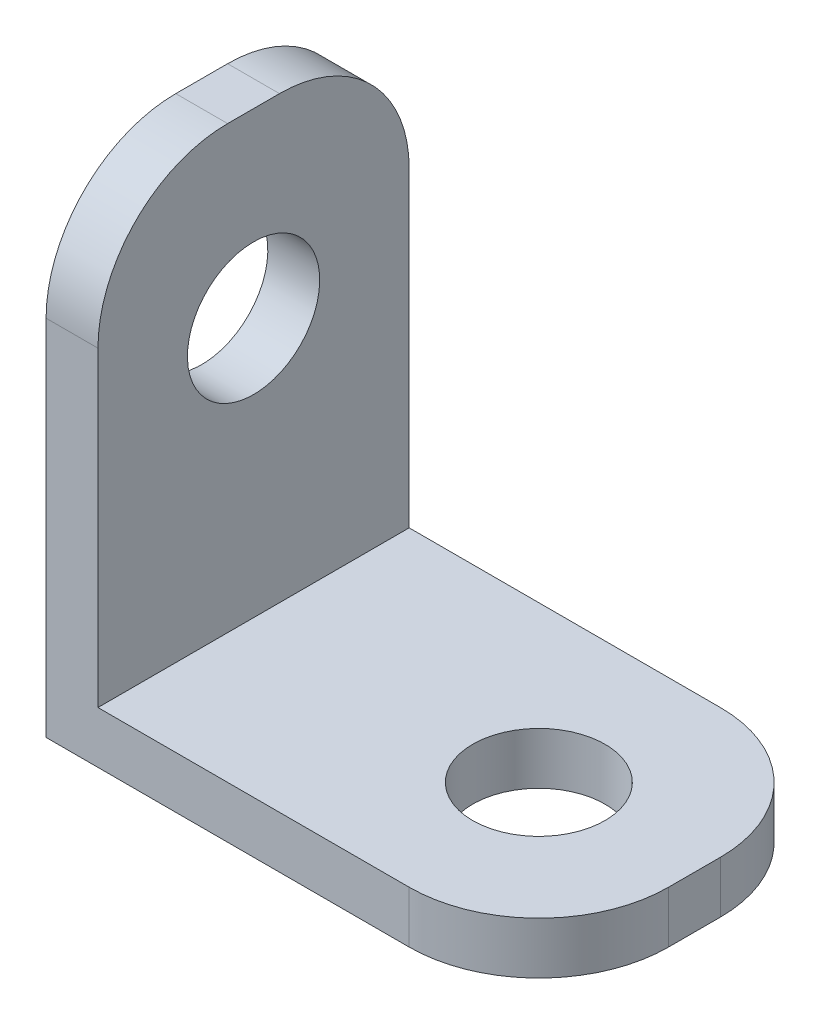
ISO-10303-21;
HEADER;
FILE_DESCRIPTION(('STEP AP214'),'2;1');
FILE_NAME('part.step','',(''),(''),'','','');
FILE_SCHEMA(('AUTOMOTIVE_DESIGN { 1 0 10303 214 1 1 1 1 }'));
ENDSEC;
DATA;
#1=APPLICATION_CONTEXT('core data for automotive mechanical design processes');
#2=APPLICATION_PROTOCOL_DEFINITION('international standard','automotive_design',2000,#1);
#3=PRODUCT_CONTEXT('',#1,'mechanical');
#4=PRODUCT('Part','Part','',(#3));
#5=PRODUCT_RELATED_PRODUCT_CATEGORY('part','',(#4));
#6=PRODUCT_DEFINITION_FORMATION('','',#4);
#7=PRODUCT_DEFINITION_CONTEXT('part definition',#1,'design');
#8=PRODUCT_DEFINITION('design','',#6,#7);
#9=PRODUCT_DEFINITION_SHAPE('','',#8);
#10=(LENGTH_UNIT() NAMED_UNIT(*) SI_UNIT(.MILLI.,.METRE.));
#11=(NAMED_UNIT(*) PLANE_ANGLE_UNIT() SI_UNIT($,.RADIAN.));
#12=(NAMED_UNIT(*) SI_UNIT($,.STERADIAN.) SOLID_ANGLE_UNIT());
#13=UNCERTAINTY_MEASURE_WITH_UNIT(LENGTH_MEASURE(1.E-05),#10,'distance_accuracy_value','');
#14=(GEOMETRIC_REPRESENTATION_CONTEXT(3) GLOBAL_UNCERTAINTY_ASSIGNED_CONTEXT((#13)) GLOBAL_UNIT_ASSIGNED_CONTEXT((#10,
#11,#12)) REPRESENTATION_CONTEXT('',''));
#15=CARTESIAN_POINT('',(0.,0.,0.));
#16=DIRECTION('',(0.,0.,1.));
#17=DIRECTION('',(1.,0.,0.));
#18=AXIS2_PLACEMENT_3D('',#15,#16,#17);
#19=CARTESIAN_POINT('',(19.,2.,12.));
#20=DIRECTION('',(-1.,0.,0.));
#21=DIRECTION('',(0.,0.,1.));
#22=AXIS2_PLACEMENT_3D('',#19,#20,#21);
#23=PLANE('',#22);
#24=DIRECTION('',(0.,0.,-1.));
#25=VECTOR('',#24,1.);
#26=CARTESIAN_POINT('',(19.,2.,12.));
#27=LINE('',#26,#25);
#28=CARTESIAN_POINT('',(19.,2.,7.));
#29=VERTEX_POINT('',#28);
#30=CARTESIAN_POINT('',(19.,2.,5.));
#31=VERTEX_POINT('',#30);
#32=EDGE_CURVE('E41',#29,#31,#27,.T.);
#33=ORIENTED_EDGE('',*,*,#32,.F.);
#34=DIRECTION('',(0.,1.,0.));
#35=VECTOR('',#34,1.);
#36=CARTESIAN_POINT('',(19.,0.,7.));
#37=LINE('',#36,#35);
#38=CARTESIAN_POINT('',(19.,0.,7.));
#39=VERTEX_POINT('',#38);
#40=EDGE_CURVE('E115',#39,#29,#37,.T.);
#41=ORIENTED_EDGE('',*,*,#40,.F.);
#42=DIRECTION('',(0.,0.,-1.));
#43=VECTOR('',#42,1.);
#44=CARTESIAN_POINT('',(19.,0.,12.));
#45=LINE('',#44,#43);
#46=CARTESIAN_POINT('',(19.,0.,5.));
#47=VERTEX_POINT('',#46);
#48=EDGE_CURVE('E11',#39,#47,#45,.T.);
#49=ORIENTED_EDGE('',*,*,#48,.T.);
#50=DIRECTION('',(0.,1.,0.));
#51=VECTOR('',#50,1.);
#52=CARTESIAN_POINT('',(19.,0.,5.));
#53=LINE('',#52,#51);
#54=EDGE_CURVE('E169',#47,#31,#53,.T.);
#55=ORIENTED_EDGE('',*,*,#54,.T.);
#56=EDGE_LOOP('',(#33,#41,#49,#55));
#57=FACE_BOUND('',#56,.T.);
#58=ADVANCED_FACE('F33',(#57),#23,.F.);
#59=CARTESIAN_POINT('',(0.,0.,12.));
#60=DIRECTION('',(0.,0.,-1.));
#61=DIRECTION('',(-1.,0.,0.));
#62=AXIS2_PLACEMENT_3D('',#59,#60,#61);
#63=PLANE('',#62);
#64=DIRECTION('',(0.,1.,0.));
#65=VECTOR('',#64,1.);
#66=CARTESIAN_POINT('',(14.,0.,12.));
#67=LINE('',#66,#65);
#68=CARTESIAN_POINT('',(14.,0.,12.));
#69=VERTEX_POINT('',#68);
#70=CARTESIAN_POINT('',(14.,2.,12.));
#71=VERTEX_POINT('',#70);
#72=EDGE_CURVE('E107',#69,#71,#67,.T.);
#73=ORIENTED_EDGE('',*,*,#72,.T.);
#74=DIRECTION('',(-1.,0.,0.));
#75=VECTOR('',#74,1.);
#76=CARTESIAN_POINT('',(2.,2.,12.));
#77=LINE('',#76,#75);
#78=CARTESIAN_POINT('',(2.,2.,12.));
#79=VERTEX_POINT('',#78);
#80=EDGE_CURVE('E128',#71,#79,#77,.T.);
#81=ORIENTED_EDGE('',*,*,#80,.T.);
#82=DIRECTION('',(0.,1.,0.));
#83=VECTOR('',#82,1.);
#84=CARTESIAN_POINT('',(2.,19.,12.));
#85=LINE('',#84,#83);
#86=CARTESIAN_POINT('',(2.,14.,12.));
#87=VERTEX_POINT('',#86);
#88=EDGE_CURVE('E131',#79,#87,#85,.T.);
#89=ORIENTED_EDGE('',*,*,#88,.T.);
#90=DIRECTION('',(1.,0.,0.));
#91=VECTOR('',#90,1.);
#92=CARTESIAN_POINT('',(0.,14.,12.));
#93=LINE('',#92,#91);
#94=CARTESIAN_POINT('',(0.,14.,12.));
#95=VERTEX_POINT('',#94);
#96=EDGE_CURVE('E147',#95,#87,#93,.T.);
#97=ORIENTED_EDGE('',*,*,#96,.F.);
#98=DIRECTION('',(0.,-1.,0.));
#99=VECTOR('',#98,1.);
#100=CARTESIAN_POINT('',(0.,0.,12.));
#101=LINE('',#100,#99);
#102=CARTESIAN_POINT('',(0.,0.,12.));
#103=VERTEX_POINT('',#102);
#104=EDGE_CURVE('E126',#95,#103,#101,.T.);
#105=ORIENTED_EDGE('',*,*,#104,.T.);
#106=DIRECTION('',(1.,0.,0.));
#107=VECTOR('',#106,1.);
#108=CARTESIAN_POINT('',(19.,0.,12.));
#109=LINE('',#108,#107);
#110=EDGE_CURVE('E121',#103,#69,#109,.T.);
#111=ORIENTED_EDGE('',*,*,#110,.T.);
#112=EDGE_LOOP('',(#73,#81,#89,#97,#105,#111));
#113=FACE_BOUND('',#112,.T.);
#114=ADVANCED_FACE('F123',(#113),#63,.F.);
#115=CARTESIAN_POINT('',(0.,0.,0.));
#116=DIRECTION('',(0.,0.,-1.));
#117=DIRECTION('',(-1.,0.,0.));
#118=AXIS2_PLACEMENT_3D('',#115,#116,#117);
#119=PLANE('',#118);
#120=DIRECTION('',(-1.,0.,0.));
#121=VECTOR('',#120,1.);
#122=CARTESIAN_POINT('',(2.,2.,0.));
#123=LINE('',#122,#121);
#124=CARTESIAN_POINT('',(14.,2.,0.));
#125=VERTEX_POINT('',#124);
#126=CARTESIAN_POINT('',(2.,2.,0.));
#127=VERTEX_POINT('',#126);
#128=EDGE_CURVE('E146',#125,#127,#123,.T.);
#129=ORIENTED_EDGE('',*,*,#128,.F.);
#130=DIRECTION('',(0.,1.,0.));
#131=VECTOR('',#130,1.);
#132=CARTESIAN_POINT('',(14.,0.,0.));
#133=LINE('',#132,#131);
#134=CARTESIAN_POINT('',(14.,0.,0.));
#135=VERTEX_POINT('',#134);
#136=EDGE_CURVE('E170',#135,#125,#133,.T.);
#137=ORIENTED_EDGE('',*,*,#136,.F.);
#138=DIRECTION('',(1.,0.,0.));
#139=VECTOR('',#138,1.);
#140=CARTESIAN_POINT('',(19.,0.,0.));
#141=LINE('',#140,#139);
#142=CARTESIAN_POINT('',(0.,0.,0.));
#143=VERTEX_POINT('',#142);
#144=EDGE_CURVE('E143',#143,#135,#141,.T.);
#145=ORIENTED_EDGE('',*,*,#144,.F.);
#146=DIRECTION('',(0.,-1.,0.));
#147=VECTOR('',#146,1.);
#148=CARTESIAN_POINT('',(0.,0.,0.));
#149=LINE('',#148,#147);
#150=CARTESIAN_POINT('',(0.,14.,0.));
#151=VERTEX_POINT('',#150);
#152=EDGE_CURVE('E129',#151,#143,#149,.T.);
#153=ORIENTED_EDGE('',*,*,#152,.F.);
#154=DIRECTION('',(1.,0.,0.));
#155=VECTOR('',#154,1.);
#156=CARTESIAN_POINT('',(0.,14.,0.));
#157=LINE('',#156,#155);
#158=CARTESIAN_POINT('',(2.,14.,0.));
#159=VERTEX_POINT('',#158);
#160=EDGE_CURVE('E186',#151,#159,#157,.T.);
#161=ORIENTED_EDGE('',*,*,#160,.T.);
#162=DIRECTION('',(0.,1.,0.));
#163=VECTOR('',#162,1.);
#164=CARTESIAN_POINT('',(2.,19.,0.));
#165=LINE('',#164,#163);
#166=EDGE_CURVE('E133',#127,#159,#165,.T.);
#167=ORIENTED_EDGE('',*,*,#166,.F.);
#168=EDGE_LOOP('',(#129,#137,#145,#153,#161,#167));
#169=FACE_BOUND('',#168,.T.);
#170=ADVANCED_FACE('F213',(#169),#119,.T.);
#171=CARTESIAN_POINT('',(0.,19.,12.));
#172=DIRECTION('',(0.,-1.,0.));
#173=DIRECTION('',(0.,0.,-1.));
#174=AXIS2_PLACEMENT_3D('',#171,#172,#173);
#175=PLANE('',#174);
#176=DIRECTION('',(0.,0.,-1.));
#177=VECTOR('',#176,1.);
#178=CARTESIAN_POINT('',(2.,19.,12.));
#179=LINE('',#178,#177);
#180=CARTESIAN_POINT('',(2.,19.,7.));
#181=VERTEX_POINT('',#180);
#182=CARTESIAN_POINT('',(2.,19.,5.));
#183=VERTEX_POINT('',#182);
#184=EDGE_CURVE('E155',#181,#183,#179,.T.);
#185=ORIENTED_EDGE('',*,*,#184,.T.);
#186=DIRECTION('',(1.,0.,0.));
#187=VECTOR('',#186,1.);
#188=CARTESIAN_POINT('',(0.,19.,5.));
#189=LINE('',#188,#187);
#190=CARTESIAN_POINT('',(0.,19.,5.));
#191=VERTEX_POINT('',#190);
#192=EDGE_CURVE('E188',#191,#183,#189,.T.);
#193=ORIENTED_EDGE('',*,*,#192,.F.);
#194=DIRECTION('',(0.,0.,-1.));
#195=VECTOR('',#194,1.);
#196=CARTESIAN_POINT('',(0.,19.,12.));
#197=LINE('',#196,#195);
#198=CARTESIAN_POINT('',(0.,19.,7.));
#199=VERTEX_POINT('',#198);
#200=EDGE_CURVE('E152',#199,#191,#197,.T.);
#201=ORIENTED_EDGE('',*,*,#200,.F.);
#202=DIRECTION('',(1.,0.,0.));
#203=VECTOR('',#202,1.);
#204=CARTESIAN_POINT('',(0.,19.,7.));
#205=LINE('',#204,#203);
#206=EDGE_CURVE('E136',#199,#181,#205,.T.);
#207=ORIENTED_EDGE('',*,*,#206,.T.);
#208=EDGE_LOOP('',(#185,#193,#201,#207));
#209=FACE_BOUND('',#208,.T.);
#210=ADVANCED_FACE('F202',(#209),#175,.F.);
#211=CARTESIAN_POINT('',(19.,0.,12.));
#212=DIRECTION('',(0.,1.,0.));
#213=DIRECTION('',(-1.,0.,0.));
#214=AXIS2_PLACEMENT_3D('',#211,#212,#213);
#215=PLANE('',#214);
#216=CARTESIAN_POINT('',(13.,0.,6.));
#217=DIRECTION('',(0.,1.,0.));
#218=DIRECTION('',(0.,0.,1.));
#219=AXIS2_PLACEMENT_3D('',#216,#217,#218);
#220=CIRCLE('',#219,2.55);
#221=CARTESIAN_POINT('',(13.,0.,8.55));
#222=VERTEX_POINT('',#221);
#223=EDGE_CURVE('E220',#222,#222,#220,.T.);
#224=ORIENTED_EDGE('',*,*,#223,.T.);
#225=EDGE_LOOP('',(#224));
#226=FACE_BOUND('',#225,.T.);
#227=ORIENTED_EDGE('',*,*,#48,.F.);
#228=CARTESIAN_POINT('',(14.,0.,7.));
#229=DIRECTION('',(0.,-1.,0.));
#230=DIRECTION('',(0.,0.,1.));
#231=AXIS2_PLACEMENT_3D('',#228,#229,#230);
#232=CIRCLE('',#231,5.);
#233=EDGE_CURVE('E110',#39,#69,#232,.T.);
#234=ORIENTED_EDGE('',*,*,#233,.T.);
#235=ORIENTED_EDGE('',*,*,#110,.F.);
#236=DIRECTION('',(0.,0.,-1.));
#237=VECTOR('',#236,1.);
#238=CARTESIAN_POINT('',(0.,0.,12.));
#239=LINE('',#238,#237);
#240=EDGE_CURVE('E142',#103,#143,#239,.T.);
#241=ORIENTED_EDGE('',*,*,#240,.T.);
#242=ORIENTED_EDGE('',*,*,#144,.T.);
#243=CARTESIAN_POINT('',(14.,0.,5.));
#244=DIRECTION('',(0.,-1.,0.));
#245=DIRECTION('',(0.,0.,-1.));
#246=AXIS2_PLACEMENT_3D('',#243,#244,#245);
#247=CIRCLE('',#246,5.);
#248=EDGE_CURVE('E56',#135,#47,#247,.T.);
#249=ORIENTED_EDGE('',*,*,#248,.T.);
#250=EDGE_LOOP('',(#227,#234,#235,#241,#242,#249));
#251=FACE_BOUND('',#250,.T.);
#252=ADVANCED_FACE('F35',(#226,#251),#215,.F.);
#253=CARTESIAN_POINT('',(2.,2.,12.));
#254=DIRECTION('',(0.,-1.,0.));
#255=DIRECTION('',(0.,0.,-1.));
#256=AXIS2_PLACEMENT_3D('',#253,#254,#255);
#257=PLANE('',#256);
#258=CARTESIAN_POINT('',(13.,2.,6.));
#259=DIRECTION('',(0.,1.,0.));
#260=DIRECTION('',(0.,0.,1.));
#261=AXIS2_PLACEMENT_3D('',#258,#259,#260);
#262=CIRCLE('',#261,2.55);
#263=CARTESIAN_POINT('',(13.,2.,8.55));
#264=VERTEX_POINT('',#263);
#265=EDGE_CURVE('E222',#264,#264,#262,.T.);
#266=ORIENTED_EDGE('',*,*,#265,.F.);
#267=EDGE_LOOP('',(#266));
#268=FACE_BOUND('',#267,.T.);
#269=ORIENTED_EDGE('',*,*,#80,.F.);
#270=CARTESIAN_POINT('',(14.,2.,7.));
#271=DIRECTION('',(0.,-1.,0.));
#272=DIRECTION('',(0.,0.,1.));
#273=AXIS2_PLACEMENT_3D('',#270,#271,#272);
#274=CIRCLE('',#273,5.);
#275=EDGE_CURVE('E48',#29,#71,#274,.T.);
#276=ORIENTED_EDGE('',*,*,#275,.F.);
#277=ORIENTED_EDGE('',*,*,#32,.T.);
#278=CARTESIAN_POINT('',(14.,2.,5.));
#279=DIRECTION('',(0.,-1.,0.));
#280=DIRECTION('',(0.,0.,-1.));
#281=AXIS2_PLACEMENT_3D('',#278,#279,#280);
#282=CIRCLE('',#281,5.);
#283=EDGE_CURVE('E165',#125,#31,#282,.T.);
#284=ORIENTED_EDGE('',*,*,#283,.F.);
#285=ORIENTED_EDGE('',*,*,#128,.T.);
#286=DIRECTION('',(0.,0.,-1.));
#287=VECTOR('',#286,1.);
#288=CARTESIAN_POINT('',(2.,2.,12.));
#289=LINE('',#288,#287);
#290=EDGE_CURVE('E158',#79,#127,#289,.T.);
#291=ORIENTED_EDGE('',*,*,#290,.F.);
#292=EDGE_LOOP('',(#269,#276,#277,#284,#285,#291));
#293=FACE_BOUND('',#292,.T.);
#294=ADVANCED_FACE('F164',(#268,#293),#257,.F.);
#295=CARTESIAN_POINT('',(2.,19.,12.));
#296=DIRECTION('',(-1.,0.,0.));
#297=DIRECTION('',(0.,-1.,0.));
#298=AXIS2_PLACEMENT_3D('',#295,#296,#297);
#299=PLANE('',#298);
#300=CARTESIAN_POINT('',(2.,12.,6.));
#301=DIRECTION('',(1.,0.,0.));
#302=DIRECTION('',(0.,1.,0.));
#303=AXIS2_PLACEMENT_3D('',#300,#301,#302);
#304=CIRCLE('',#303,2.55);
#305=CARTESIAN_POINT('',(2.,14.55,6.));
#306=VERTEX_POINT('',#305);
#307=EDGE_CURVE('E172',#306,#306,#304,.T.);
#308=ORIENTED_EDGE('',*,*,#307,.F.);
#309=EDGE_LOOP('',(#308));
#310=FACE_BOUND('',#309,.T.);
#311=ORIENTED_EDGE('',*,*,#166,.T.);
#312=CARTESIAN_POINT('',(2.,14.,5.));
#313=DIRECTION('',(-1.,0.,0.));
#314=DIRECTION('',(0.,1.,0.));
#315=AXIS2_PLACEMENT_3D('',#312,#313,#314);
#316=CIRCLE('',#315,5.);
#317=EDGE_CURVE('E180',#183,#159,#316,.T.);
#318=ORIENTED_EDGE('',*,*,#317,.F.);
#319=ORIENTED_EDGE('',*,*,#184,.F.);
#320=CARTESIAN_POINT('',(2.,14.,7.));
#321=DIRECTION('',(-1.,0.,0.));
#322=DIRECTION('',(0.,-1.,0.));
#323=AXIS2_PLACEMENT_3D('',#320,#321,#322);
#324=CIRCLE('',#323,5.);
#325=EDGE_CURVE('E190',#87,#181,#324,.T.);
#326=ORIENTED_EDGE('',*,*,#325,.F.);
#327=ORIENTED_EDGE('',*,*,#88,.F.);
#328=ORIENTED_EDGE('',*,*,#290,.T.);
#329=EDGE_LOOP('',(#311,#318,#319,#326,#327,#328));
#330=FACE_BOUND('',#329,.T.);
#331=ADVANCED_FACE('F206',(#310,#330),#299,.F.);
#332=CARTESIAN_POINT('',(0.,0.,12.));
#333=DIRECTION('',(1.,0.,0.));
#334=DIRECTION('',(0.,0.,-1.));
#335=AXIS2_PLACEMENT_3D('',#332,#333,#334);
#336=PLANE('',#335);
#337=CARTESIAN_POINT('',(0.,12.,6.));
#338=DIRECTION('',(1.,0.,0.));
#339=DIRECTION('',(0.,1.,0.));
#340=AXIS2_PLACEMENT_3D('',#337,#338,#339);
#341=CIRCLE('',#340,2.55);
#342=CARTESIAN_POINT('',(0.,14.55,6.));
#343=VERTEX_POINT('',#342);
#344=EDGE_CURVE('E177',#343,#343,#341,.T.);
#345=ORIENTED_EDGE('',*,*,#344,.T.);
#346=EDGE_LOOP('',(#345));
#347=FACE_BOUND('',#346,.T.);
#348=ORIENTED_EDGE('',*,*,#200,.T.);
#349=CARTESIAN_POINT('',(0.,14.,5.));
#350=DIRECTION('',(-1.,0.,0.));
#351=DIRECTION('',(0.,1.,0.));
#352=AXIS2_PLACEMENT_3D('',#349,#350,#351);
#353=CIRCLE('',#352,5.);
#354=EDGE_CURVE('E183',#191,#151,#353,.T.);
#355=ORIENTED_EDGE('',*,*,#354,.T.);
#356=ORIENTED_EDGE('',*,*,#152,.T.);
#357=ORIENTED_EDGE('',*,*,#240,.F.);
#358=ORIENTED_EDGE('',*,*,#104,.F.);
#359=CARTESIAN_POINT('',(0.,14.,7.));
#360=DIRECTION('',(-1.,0.,0.));
#361=DIRECTION('',(0.,-1.,0.));
#362=AXIS2_PLACEMENT_3D('',#359,#360,#361);
#363=CIRCLE('',#362,5.);
#364=EDGE_CURVE('E193',#95,#199,#363,.T.);
#365=ORIENTED_EDGE('',*,*,#364,.T.);
#366=EDGE_LOOP('',(#348,#355,#356,#357,#358,#365));
#367=FACE_BOUND('',#366,.T.);
#368=ADVANCED_FACE('F216',(#347,#367),#336,.F.);
#369=CARTESIAN_POINT('',(0.,14.,5.));
#370=DIRECTION('',(1.,0.,0.));
#371=DIRECTION('',(0.,1.,0.));
#372=AXIS2_PLACEMENT_3D('',#369,#370,#371);
#373=CYLINDRICAL_SURFACE('',#372,5.);
#374=ORIENTED_EDGE('',*,*,#317,.T.);
#375=ORIENTED_EDGE('',*,*,#160,.F.);
#376=ORIENTED_EDGE('',*,*,#354,.F.);
#377=ORIENTED_EDGE('',*,*,#192,.T.);
#378=EDGE_LOOP('',(#374,#375,#376,#377));
#379=FACE_BOUND('',#378,.T.);
#380=ADVANCED_FACE('F210',(#379),#373,.T.);
#381=CARTESIAN_POINT('',(0.,14.,7.));
#382=DIRECTION('',(1.,0.,0.));
#383=DIRECTION('',(0.,1.,0.));
#384=AXIS2_PLACEMENT_3D('',#381,#382,#383);
#385=CYLINDRICAL_SURFACE('',#384,5.);
#386=ORIENTED_EDGE('',*,*,#325,.T.);
#387=ORIENTED_EDGE('',*,*,#206,.F.);
#388=ORIENTED_EDGE('',*,*,#364,.F.);
#389=ORIENTED_EDGE('',*,*,#96,.T.);
#390=EDGE_LOOP('',(#386,#387,#388,#389));
#391=FACE_BOUND('',#390,.T.);
#392=ADVANCED_FACE('F217',(#391),#385,.T.);
#393=CARTESIAN_POINT('',(0.,12.,6.));
#394=DIRECTION('',(1.,0.,0.));
#395=DIRECTION('',(0.,1.,0.));
#396=AXIS2_PLACEMENT_3D('',#393,#394,#395);
#397=CYLINDRICAL_SURFACE('',#396,2.55);
#398=ORIENTED_EDGE('',*,*,#344,.F.);
#399=EDGE_LOOP('',(#398));
#400=FACE_BOUND('',#399,.T.);
#401=ORIENTED_EDGE('',*,*,#307,.T.);
#402=EDGE_LOOP('',(#401));
#403=FACE_BOUND('',#402,.T.);
#404=ADVANCED_FACE('F282',(#400,#403),#397,.F.);
#405=CARTESIAN_POINT('',(14.,0.,5.));
#406=DIRECTION('',(0.,1.,0.));
#407=DIRECTION('',(0.,0.,1.));
#408=AXIS2_PLACEMENT_3D('',#405,#406,#407);
#409=CYLINDRICAL_SURFACE('',#408,5.);
#410=ORIENTED_EDGE('',*,*,#283,.T.);
#411=ORIENTED_EDGE('',*,*,#54,.F.);
#412=ORIENTED_EDGE('',*,*,#248,.F.);
#413=ORIENTED_EDGE('',*,*,#136,.T.);
#414=EDGE_LOOP('',(#410,#411,#412,#413));
#415=FACE_BOUND('',#414,.T.);
#416=ADVANCED_FACE('F219',(#415),#409,.T.);
#417=CARTESIAN_POINT('',(14.,0.,7.));
#418=DIRECTION('',(0.,1.,0.));
#419=DIRECTION('',(0.,0.,1.));
#420=AXIS2_PLACEMENT_3D('',#417,#418,#419);
#421=CYLINDRICAL_SURFACE('',#420,5.);
#422=ORIENTED_EDGE('',*,*,#275,.T.);
#423=ORIENTED_EDGE('',*,*,#72,.F.);
#424=ORIENTED_EDGE('',*,*,#233,.F.);
#425=ORIENTED_EDGE('',*,*,#40,.T.);
#426=EDGE_LOOP('',(#422,#423,#424,#425));
#427=FACE_BOUND('',#426,.T.);
#428=ADVANCED_FACE('F109',(#427),#421,.T.);
#429=CARTESIAN_POINT('',(13.,0.,6.));
#430=DIRECTION('',(0.,1.,0.));
#431=DIRECTION('',(0.,0.,1.));
#432=AXIS2_PLACEMENT_3D('',#429,#430,#431);
#433=CYLINDRICAL_SURFACE('',#432,2.55);
#434=ORIENTED_EDGE('',*,*,#223,.F.);
#435=EDGE_LOOP('',(#434));
#436=FACE_BOUND('',#435,.T.);
#437=ORIENTED_EDGE('',*,*,#265,.T.);
#438=EDGE_LOOP('',(#437));
#439=FACE_BOUND('',#438,.T.);
#440=ADVANCED_FACE('F230',(#436,#439),#433,.F.);
#441=CLOSED_SHELL('',(#58,#114,#170,#210,#252,#294,#331,#368,#380,#392,#404,#416,#428,#440));
#442=MANIFOLD_SOLID_BREP('B2',#441);
#443=ADVANCED_BREP_SHAPE_REPRESENTATION('',(#18,#442),#14);
#444=SHAPE_DEFINITION_REPRESENTATION(#9,#443);
ENDSEC;
END-ISO-10303-21;
